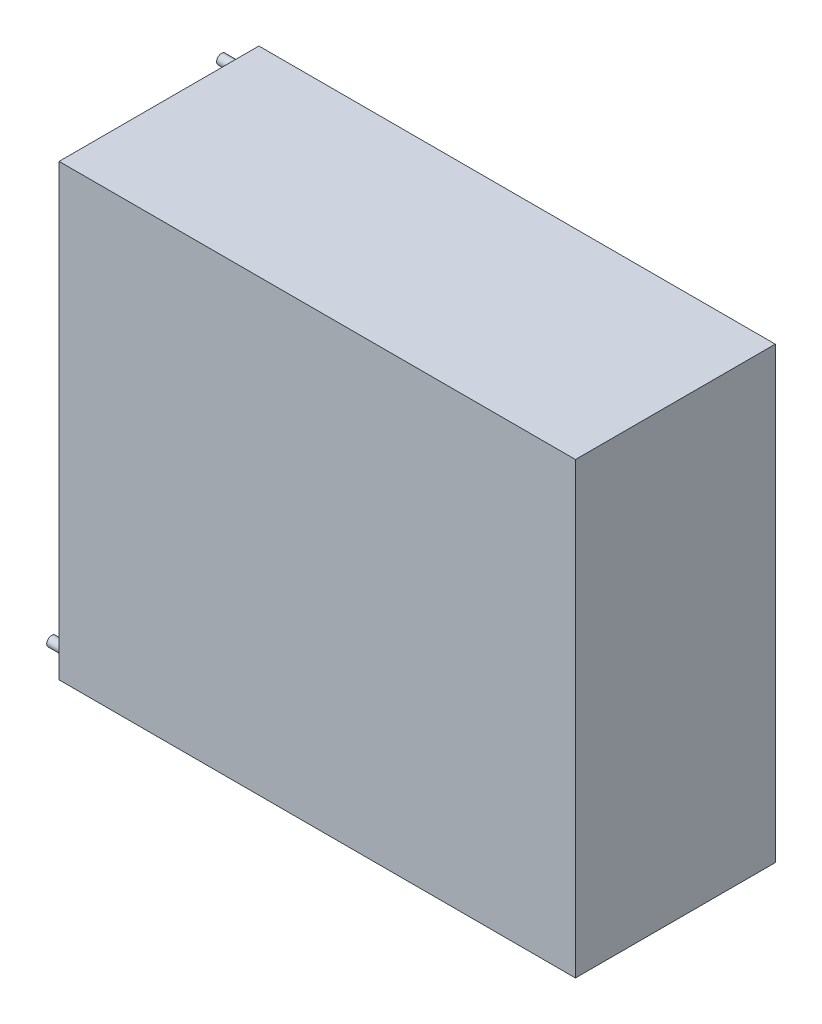
ISO-10303-21;
HEADER;
FILE_DESCRIPTION(('STEP AP214'),'2;1');
FILE_NAME('part.step','',(''),(''),'','','');
FILE_SCHEMA(('AUTOMOTIVE_DESIGN { 1 0 10303 214 1 1 1 1 }'));
ENDSEC;
DATA;
#1=APPLICATION_CONTEXT('core data for automotive mechanical design processes');
#2=APPLICATION_PROTOCOL_DEFINITION('international standard','automotive_design',2000,#1);
#3=PRODUCT_CONTEXT('',#1,'mechanical');
#4=PRODUCT('Part','Part','',(#3));
#5=PRODUCT_RELATED_PRODUCT_CATEGORY('part','',(#4));
#6=PRODUCT_DEFINITION_FORMATION('','',#4);
#7=PRODUCT_DEFINITION_CONTEXT('part definition',#1,'design');
#8=PRODUCT_DEFINITION('design','',#6,#7);
#9=PRODUCT_DEFINITION_SHAPE('','',#8);
#10=(LENGTH_UNIT() NAMED_UNIT(*) SI_UNIT(.MILLI.,.METRE.));
#11=(NAMED_UNIT(*) PLANE_ANGLE_UNIT() SI_UNIT($,.RADIAN.));
#12=(NAMED_UNIT(*) SI_UNIT($,.STERADIAN.) SOLID_ANGLE_UNIT());
#13=UNCERTAINTY_MEASURE_WITH_UNIT(LENGTH_MEASURE(1.E-05),#10,'distance_accuracy_value','');
#14=(GEOMETRIC_REPRESENTATION_CONTEXT(3) GLOBAL_UNCERTAINTY_ASSIGNED_CONTEXT((#13)) GLOBAL_UNIT_ASSIGNED_CONTEXT((#10,
#11,#12)) REPRESENTATION_CONTEXT('',''));
#15=CARTESIAN_POINT('',(0.,0.,0.));
#16=DIRECTION('',(0.,0.,1.));
#17=DIRECTION('',(1.,0.,0.));
#18=AXIS2_PLACEMENT_3D('',#15,#16,#17);
#19=CARTESIAN_POINT('',(-34.5,-30.,26.7));
#20=DIRECTION('',(1.,0.,0.));
#21=DIRECTION('',(0.,1.,0.));
#22=AXIS2_PLACEMENT_3D('',#19,#20,#21);
#23=PLANE('',#22);
#24=CARTESIAN_POINT('',(-34.5,-28.,24.7));
#25=DIRECTION('',(1.,0.,0.));
#26=DIRECTION('',(0.,1.,0.));
#27=AXIS2_PLACEMENT_3D('',#24,#25,#26);
#28=CIRCLE('',#27,0.650000000000001);
#29=CARTESIAN_POINT('',(-34.5,-27.35,24.7));
#30=VERTEX_POINT('',#29);
#31=EDGE_CURVE('E41',#30,#30,#28,.F.);
#32=ORIENTED_EDGE('',*,*,#31,.F.);
#33=EDGE_LOOP('',(#32));
#34=FACE_BOUND('',#33,.T.);
#35=DIRECTION('',(0.,-1.,0.));
#36=VECTOR('',#35,1.);
#37=CARTESIAN_POINT('',(-34.5,-30.,0.));
#38=LINE('',#37,#36);
#39=CARTESIAN_POINT('',(-34.5,30.,0.));
#40=VERTEX_POINT('',#39);
#41=CARTESIAN_POINT('',(-34.5,-30.,0.));
#42=VERTEX_POINT('',#41);
#43=EDGE_CURVE('E100',#40,#42,#38,.T.);
#44=ORIENTED_EDGE('',*,*,#43,.T.);
#45=DIRECTION('',(0.,0.,-1.));
#46=VECTOR('',#45,1.);
#47=CARTESIAN_POINT('',(-34.5,-30.,26.7));
#48=LINE('',#47,#46);
#49=CARTESIAN_POINT('',(-34.5,-30.,26.7));
#50=VERTEX_POINT('',#49);
#51=EDGE_CURVE('E91',#50,#42,#48,.T.);
#52=ORIENTED_EDGE('',*,*,#51,.F.);
#53=DIRECTION('',(0.,-1.,0.));
#54=VECTOR('',#53,1.);
#55=CARTESIAN_POINT('',(-34.5,-30.,26.7));
#56=LINE('',#55,#54);
#57=CARTESIAN_POINT('',(-34.5,30.,26.7));
#58=VERTEX_POINT('',#57);
#59=EDGE_CURVE('E85',#58,#50,#56,.T.);
#60=ORIENTED_EDGE('',*,*,#59,.F.);
#61=DIRECTION('',(0.,0.,-1.));
#62=VECTOR('',#61,1.);
#63=CARTESIAN_POINT('',(-34.5,30.,26.7));
#64=LINE('',#63,#62);
#65=EDGE_CURVE('E96',#58,#40,#64,.T.);
#66=ORIENTED_EDGE('',*,*,#65,.T.);
#67=EDGE_LOOP('',(#44,#52,#60,#66));
#68=FACE_BOUND('',#67,.T.);
#69=CARTESIAN_POINT('',(-34.5,28.,2.));
#70=DIRECTION('',(1.,0.,0.));
#71=DIRECTION('',(0.,1.,0.));
#72=AXIS2_PLACEMENT_3D('',#69,#70,#71);
#73=CIRCLE('',#72,0.650000000000001);
#74=CARTESIAN_POINT('',(-34.5,28.65,2.));
#75=VERTEX_POINT('',#74);
#76=EDGE_CURVE('E11',#75,#75,#73,.F.);
#77=ORIENTED_EDGE('',*,*,#76,.F.);
#78=EDGE_LOOP('',(#77));
#79=FACE_BOUND('',#78,.T.);
#80=ADVANCED_FACE('F33',(#34,#68,#79),#23,.F.);
#81=CARTESIAN_POINT('',(34.5,-30.,26.7));
#82=DIRECTION('',(0.,1.,0.));
#83=DIRECTION('',(-1.,0.,0.));
#84=AXIS2_PLACEMENT_3D('',#81,#82,#83);
#85=PLANE('',#84);
#86=DIRECTION('',(1.,0.,0.));
#87=VECTOR('',#86,1.);
#88=CARTESIAN_POINT('',(34.5,-30.,0.));
#89=LINE('',#88,#87);
#90=CARTESIAN_POINT('',(34.5,-30.,0.));
#91=VERTEX_POINT('',#90);
#92=EDGE_CURVE('E90',#42,#91,#89,.T.);
#93=ORIENTED_EDGE('',*,*,#92,.T.);
#94=DIRECTION('',(0.,0.,-1.));
#95=VECTOR('',#94,1.);
#96=CARTESIAN_POINT('',(34.5,-30.,26.7));
#97=LINE('',#96,#95);
#98=CARTESIAN_POINT('',(34.5,-30.,26.7));
#99=VERTEX_POINT('',#98);
#100=EDGE_CURVE('E88',#99,#91,#97,.T.);
#101=ORIENTED_EDGE('',*,*,#100,.F.);
#102=DIRECTION('',(1.,0.,0.));
#103=VECTOR('',#102,1.);
#104=CARTESIAN_POINT('',(34.5,-30.,26.7));
#105=LINE('',#104,#103);
#106=EDGE_CURVE('E80',#50,#99,#105,.T.);
#107=ORIENTED_EDGE('',*,*,#106,.F.);
#108=ORIENTED_EDGE('',*,*,#51,.T.);
#109=EDGE_LOOP('',(#93,#101,#107,#108));
#110=FACE_BOUND('',#109,.T.);
#111=ADVANCED_FACE('F89',(#110),#85,.F.);
#112=CARTESIAN_POINT('',(34.5,-30.,26.7));
#113=DIRECTION('',(-1.,0.,0.));
#114=DIRECTION('',(0.,0.,1.));
#115=AXIS2_PLACEMENT_3D('',#112,#113,#114);
#116=PLANE('',#115);
#117=DIRECTION('',(0.,1.,0.));
#118=VECTOR('',#117,1.);
#119=CARTESIAN_POINT('',(34.5,-30.,0.));
#120=LINE('',#119,#118);
#121=CARTESIAN_POINT('',(34.5,30.,0.));
#122=VERTEX_POINT('',#121);
#123=EDGE_CURVE('E66',#91,#122,#120,.T.);
#124=ORIENTED_EDGE('',*,*,#123,.T.);
#125=DIRECTION('',(0.,0.,-1.));
#126=VECTOR('',#125,1.);
#127=CARTESIAN_POINT('',(34.5,30.,26.7));
#128=LINE('',#127,#126);
#129=CARTESIAN_POINT('',(34.5,30.,26.7));
#130=VERTEX_POINT('',#129);
#131=EDGE_CURVE('E92',#130,#122,#128,.T.);
#132=ORIENTED_EDGE('',*,*,#131,.F.);
#133=DIRECTION('',(0.,1.,0.));
#134=VECTOR('',#133,1.);
#135=CARTESIAN_POINT('',(34.5,-30.,26.7));
#136=LINE('',#135,#134);
#137=EDGE_CURVE('E83',#99,#130,#136,.T.);
#138=ORIENTED_EDGE('',*,*,#137,.F.);
#139=ORIENTED_EDGE('',*,*,#100,.T.);
#140=EDGE_LOOP('',(#124,#132,#138,#139));
#141=FACE_BOUND('',#140,.T.);
#142=ADVANCED_FACE('F94',(#141),#116,.F.);
#143=CARTESIAN_POINT('',(34.5,30.,26.7));
#144=DIRECTION('',(0.,-1.,0.));
#145=DIRECTION('',(1.,0.,0.));
#146=AXIS2_PLACEMENT_3D('',#143,#144,#145);
#147=PLANE('',#146);
#148=DIRECTION('',(-1.,0.,0.));
#149=VECTOR('',#148,1.);
#150=CARTESIAN_POINT('',(34.5,30.,0.));
#151=LINE('',#150,#149);
#152=EDGE_CURVE('E72',#122,#40,#151,.T.);
#153=ORIENTED_EDGE('',*,*,#152,.T.);
#154=ORIENTED_EDGE('',*,*,#65,.F.);
#155=DIRECTION('',(-1.,0.,0.));
#156=VECTOR('',#155,1.);
#157=CARTESIAN_POINT('',(34.5,30.,26.7));
#158=LINE('',#157,#156);
#159=EDGE_CURVE('E49',#130,#58,#158,.T.);
#160=ORIENTED_EDGE('',*,*,#159,.F.);
#161=ORIENTED_EDGE('',*,*,#131,.T.);
#162=EDGE_LOOP('',(#153,#154,#160,#161));
#163=FACE_BOUND('',#162,.T.);
#164=ADVANCED_FACE('F142',(#163),#147,.F.);
#165=CARTESIAN_POINT('',(-34.5,30.,26.7));
#166=DIRECTION('',(0.,0.,1.));
#167=DIRECTION('',(1.,0.,0.));
#168=AXIS2_PLACEMENT_3D('',#165,#166,#167);
#169=PLANE('',#168);
#170=ORIENTED_EDGE('',*,*,#59,.T.);
#171=ORIENTED_EDGE('',*,*,#106,.T.);
#172=ORIENTED_EDGE('',*,*,#137,.T.);
#173=ORIENTED_EDGE('',*,*,#159,.T.);
#174=EDGE_LOOP('',(#170,#171,#172,#173));
#175=FACE_BOUND('',#174,.T.);
#176=ADVANCED_FACE('F81',(#175),#169,.T.);
#177=CARTESIAN_POINT('',(-34.5,30.,0.));
#178=DIRECTION('',(0.,0.,1.));
#179=DIRECTION('',(1.,0.,0.));
#180=AXIS2_PLACEMENT_3D('',#177,#178,#179);
#181=PLANE('',#180);
#182=ORIENTED_EDGE('',*,*,#43,.F.);
#183=ORIENTED_EDGE('',*,*,#152,.F.);
#184=ORIENTED_EDGE('',*,*,#123,.F.);
#185=ORIENTED_EDGE('',*,*,#92,.F.);
#186=EDGE_LOOP('',(#182,#183,#184,#185));
#187=FACE_BOUND('',#186,.T.);
#188=ADVANCED_FACE('F138',(#187),#181,.F.);
#189=CARTESIAN_POINT('',(-37.5,-28.,24.7));
#190=DIRECTION('',(1.,0.,0.));
#191=DIRECTION('',(0.,1.,0.));
#192=AXIS2_PLACEMENT_3D('',#189,#190,#191);
#193=CYLINDRICAL_SURFACE('',#192,0.650000000000001);
#194=CARTESIAN_POINT('',(-37.5,-28.,24.7));
#195=DIRECTION('',(-1.,0.,0.));
#196=DIRECTION('',(0.,-1.,0.));
#197=AXIS2_PLACEMENT_3D('',#194,#195,#196);
#198=CIRCLE('',#197,0.650000000000001);
#199=CARTESIAN_POINT('',(-37.5,-28.65,24.7));
#200=VERTEX_POINT('',#199);
#201=EDGE_CURVE('E103',#200,#200,#198,.T.);
#202=ORIENTED_EDGE('',*,*,#201,.F.);
#203=EDGE_LOOP('',(#202));
#204=FACE_BOUND('',#203,.T.);
#205=ORIENTED_EDGE('',*,*,#31,.T.);
#206=EDGE_LOOP('',(#205));
#207=FACE_BOUND('',#206,.T.);
#208=ADVANCED_FACE('F112',(#204,#207),#193,.T.);
#209=CARTESIAN_POINT('',(-37.5,-28.,24.7));
#210=DIRECTION('',(-1.,0.,0.));
#211=DIRECTION('',(0.,-1.,0.));
#212=AXIS2_PLACEMENT_3D('',#209,#210,#211);
#213=PLANE('',#212);
#214=ORIENTED_EDGE('',*,*,#201,.T.);
#215=EDGE_LOOP('',(#214));
#216=FACE_BOUND('',#215,.T.);
#217=ADVANCED_FACE('F123',(#216),#213,.T.);
#218=CARTESIAN_POINT('',(-37.5,28.,2.));
#219=DIRECTION('',(1.,0.,0.));
#220=DIRECTION('',(0.,1.,0.));
#221=AXIS2_PLACEMENT_3D('',#218,#219,#220);
#222=CYLINDRICAL_SURFACE('',#221,0.650000000000001);
#223=CARTESIAN_POINT('',(-37.5,28.,2.));
#224=DIRECTION('',(-1.,0.,0.));
#225=DIRECTION('',(0.,-1.,0.));
#226=AXIS2_PLACEMENT_3D('',#223,#224,#225);
#227=CIRCLE('',#226,0.650000000000001);
#228=CARTESIAN_POINT('',(-37.5,27.35,2.));
#229=VERTEX_POINT('',#228);
#230=EDGE_CURVE('E219',#229,#229,#227,.T.);
#231=ORIENTED_EDGE('',*,*,#230,.F.);
#232=EDGE_LOOP('',(#231));
#233=FACE_BOUND('',#232,.T.);
#234=ORIENTED_EDGE('',*,*,#76,.T.);
#235=EDGE_LOOP('',(#234));
#236=FACE_BOUND('',#235,.T.);
#237=ADVANCED_FACE('F120',(#233,#236),#222,.T.);
#238=CARTESIAN_POINT('',(-37.5,28.,2.));
#239=DIRECTION('',(-1.,0.,0.));
#240=DIRECTION('',(0.,-1.,0.));
#241=AXIS2_PLACEMENT_3D('',#238,#239,#240);
#242=PLANE('',#241);
#243=ORIENTED_EDGE('',*,*,#230,.T.);
#244=EDGE_LOOP('',(#243));
#245=FACE_BOUND('',#244,.T.);
#246=ADVANCED_FACE('F122',(#245),#242,.T.);
#247=CLOSED_SHELL('',(#80,#111,#142,#164,#176,#188,#208,#217,#237,#246));
#248=MANIFOLD_SOLID_BREP('B2',#247);
#249=ADVANCED_BREP_SHAPE_REPRESENTATION('',(#18,#248),#14);
#250=SHAPE_DEFINITION_REPRESENTATION(#9,#249);
ENDSEC;
END-ISO-10303-21;
